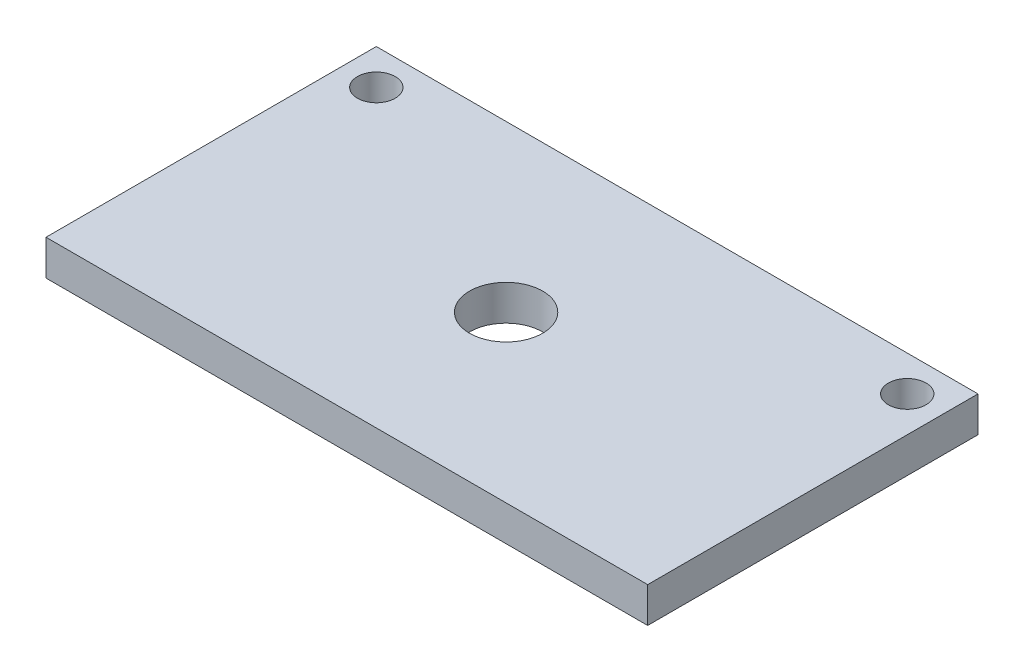
ISO-10303-21;
HEADER;
FILE_DESCRIPTION(('STEP AP214'),'2;1');
FILE_NAME('part.step','',(''),(''),'','','');
FILE_SCHEMA(('AUTOMOTIVE_DESIGN { 1 0 10303 214 1 1 1 1 }'));
ENDSEC;
DATA;
#1=APPLICATION_CONTEXT('core data for automotive mechanical design processes');
#2=APPLICATION_PROTOCOL_DEFINITION('international standard','automotive_design',2000,#1);
#3=PRODUCT_CONTEXT('',#1,'mechanical');
#4=PRODUCT('Part','Part','',(#3));
#5=PRODUCT_RELATED_PRODUCT_CATEGORY('part','',(#4));
#6=PRODUCT_DEFINITION_FORMATION('','',#4);
#7=PRODUCT_DEFINITION_CONTEXT('part definition',#1,'design');
#8=PRODUCT_DEFINITION('design','',#6,#7);
#9=PRODUCT_DEFINITION_SHAPE('','',#8);
#10=(LENGTH_UNIT() NAMED_UNIT(*) SI_UNIT(.MILLI.,.METRE.));
#11=(NAMED_UNIT(*) PLANE_ANGLE_UNIT() SI_UNIT($,.RADIAN.));
#12=(NAMED_UNIT(*) SI_UNIT($,.STERADIAN.) SOLID_ANGLE_UNIT());
#13=UNCERTAINTY_MEASURE_WITH_UNIT(LENGTH_MEASURE(1.E-05),#10,'distance_accuracy_value','');
#14=(GEOMETRIC_REPRESENTATION_CONTEXT(3) GLOBAL_UNCERTAINTY_ASSIGNED_CONTEXT((#13)) GLOBAL_UNIT_ASSIGNED_CONTEXT((#10,
#11,#12)) REPRESENTATION_CONTEXT('',''));
#15=CARTESIAN_POINT('',(0.,0.,0.));
#16=DIRECTION('',(0.,0.,1.));
#17=DIRECTION('',(1.,0.,0.));
#18=AXIS2_PLACEMENT_3D('',#15,#16,#17);
#19=CARTESIAN_POINT('',(-26.5822784810127,3.,-14.2405063291139));
#20=DIRECTION('',(1.,0.,0.));
#21=DIRECTION('',(0.,0.,-1.));
#22=AXIS2_PLACEMENT_3D('',#19,#20,#21);
#23=PLANE('',#22);
#24=DIRECTION('',(0.,0.,1.));
#25=VECTOR('',#24,1.);
#26=CARTESIAN_POINT('',(-26.5822784810127,0.,-14.2405063291139));
#27=LINE('',#26,#25);
#28=CARTESIAN_POINT('',(-26.5822784810127,0.,-14.2405063291139));
#29=VERTEX_POINT('',#28);
#30=CARTESIAN_POINT('',(-26.5822784810127,0.,13.7594936708861));
#31=VERTEX_POINT('',#30);
#32=EDGE_CURVE('E96',#29,#31,#27,.T.);
#33=ORIENTED_EDGE('',*,*,#32,.T.);
#34=DIRECTION('',(0.,-1.,0.));
#35=VECTOR('',#34,1.);
#36=CARTESIAN_POINT('',(-26.5822784810127,3.,13.7594936708861));
#37=LINE('',#36,#35);
#38=CARTESIAN_POINT('',(-26.5822784810127,3.,13.7594936708861));
#39=VERTEX_POINT('',#38);
#40=EDGE_CURVE('E11',#39,#31,#37,.T.);
#41=ORIENTED_EDGE('',*,*,#40,.F.);
#42=DIRECTION('',(0.,0.,1.));
#43=VECTOR('',#42,1.);
#44=CARTESIAN_POINT('',(-26.5822784810127,3.,-14.2405063291139));
#45=LINE('',#44,#43);
#46=CARTESIAN_POINT('',(-26.5822784810127,3.,-14.2405063291139));
#47=VERTEX_POINT('',#46);
#48=EDGE_CURVE('E84',#47,#39,#45,.T.);
#49=ORIENTED_EDGE('',*,*,#48,.F.);
#50=DIRECTION('',(0.,-1.,0.));
#51=VECTOR('',#50,1.);
#52=CARTESIAN_POINT('',(-26.5822784810127,3.,-14.2405063291139));
#53=LINE('',#52,#51);
#54=EDGE_CURVE('E92',#47,#29,#53,.T.);
#55=ORIENTED_EDGE('',*,*,#54,.T.);
#56=EDGE_LOOP('',(#33,#41,#49,#55));
#57=FACE_BOUND('',#56,.T.);
#58=ADVANCED_FACE('F33',(#57),#23,.F.);
#59=CARTESIAN_POINT('',(-26.5822784810127,3.,13.7594936708861));
#60=DIRECTION('',(0.,0.,-1.));
#61=DIRECTION('',(-1.,0.,0.));
#62=AXIS2_PLACEMENT_3D('',#59,#60,#61);
#63=PLANE('',#62);
#64=DIRECTION('',(1.,0.,0.));
#65=VECTOR('',#64,1.);
#66=CARTESIAN_POINT('',(-26.5822784810127,0.,13.7594936708861));
#67=LINE('',#66,#65);
#68=CARTESIAN_POINT('',(24.4177215189873,0.,13.7594936708861));
#69=VERTEX_POINT('',#68);
#70=EDGE_CURVE('E88',#31,#69,#67,.T.);
#71=ORIENTED_EDGE('',*,*,#70,.T.);
#72=DIRECTION('',(0.,-1.,0.));
#73=VECTOR('',#72,1.);
#74=CARTESIAN_POINT('',(24.4177215189873,3.,13.7594936708861));
#75=LINE('',#74,#73);
#76=CARTESIAN_POINT('',(24.4177215189873,3.,13.7594936708861));
#77=VERTEX_POINT('',#76);
#78=EDGE_CURVE('E41',#77,#69,#75,.T.);
#79=ORIENTED_EDGE('',*,*,#78,.F.);
#80=DIRECTION('',(1.,0.,0.));
#81=VECTOR('',#80,1.);
#82=CARTESIAN_POINT('',(-26.5822784810127,3.,13.7594936708861));
#83=LINE('',#82,#81);
#84=EDGE_CURVE('E79',#39,#77,#83,.T.);
#85=ORIENTED_EDGE('',*,*,#84,.F.);
#86=ORIENTED_EDGE('',*,*,#40,.T.);
#87=EDGE_LOOP('',(#71,#79,#85,#86));
#88=FACE_BOUND('',#87,.T.);
#89=ADVANCED_FACE('F87',(#88),#63,.F.);
#90=CARTESIAN_POINT('',(24.4177215189873,3.,-14.2405063291139));
#91=DIRECTION('',(-1.,0.,0.));
#92=DIRECTION('',(0.,0.,1.));
#93=AXIS2_PLACEMENT_3D('',#90,#91,#92);
#94=PLANE('',#93);
#95=DIRECTION('',(0.,0.,-1.));
#96=VECTOR('',#95,1.);
#97=CARTESIAN_POINT('',(24.4177215189873,0.,-14.2405063291139));
#98=LINE('',#97,#96);
#99=CARTESIAN_POINT('',(24.4177215189873,0.,-14.2405063291139));
#100=VERTEX_POINT('',#99);
#101=EDGE_CURVE('E66',#69,#100,#98,.T.);
#102=ORIENTED_EDGE('',*,*,#101,.T.);
#103=DIRECTION('',(0.,-1.,0.));
#104=VECTOR('',#103,1.);
#105=CARTESIAN_POINT('',(24.4177215189873,3.,-14.2405063291139));
#106=LINE('',#105,#104);
#107=CARTESIAN_POINT('',(24.4177215189873,3.,-14.2405063291139));
#108=VERTEX_POINT('',#107);
#109=EDGE_CURVE('E89',#108,#100,#106,.T.);
#110=ORIENTED_EDGE('',*,*,#109,.F.);
#111=DIRECTION('',(0.,0.,-1.));
#112=VECTOR('',#111,1.);
#113=CARTESIAN_POINT('',(24.4177215189873,3.,-14.2405063291139));
#114=LINE('',#113,#112);
#115=EDGE_CURVE('E82',#77,#108,#114,.T.);
#116=ORIENTED_EDGE('',*,*,#115,.F.);
#117=ORIENTED_EDGE('',*,*,#78,.T.);
#118=EDGE_LOOP('',(#102,#110,#116,#117));
#119=FACE_BOUND('',#118,.T.);
#120=ADVANCED_FACE('F90',(#119),#94,.F.);
#121=CARTESIAN_POINT('',(-26.5822784810127,3.,-14.2405063291139));
#122=DIRECTION('',(0.,0.,1.));
#123=DIRECTION('',(1.,0.,0.));
#124=AXIS2_PLACEMENT_3D('',#121,#122,#123);
#125=PLANE('',#124);
#126=DIRECTION('',(-1.,0.,0.));
#127=VECTOR('',#126,1.);
#128=CARTESIAN_POINT('',(-26.5822784810127,0.,-14.2405063291139));
#129=LINE('',#128,#127);
#130=EDGE_CURVE('E72',#100,#29,#129,.T.);
#131=ORIENTED_EDGE('',*,*,#130,.T.);
#132=ORIENTED_EDGE('',*,*,#54,.F.);
#133=DIRECTION('',(-1.,0.,0.));
#134=VECTOR('',#133,1.);
#135=CARTESIAN_POINT('',(-26.5822784810127,3.,-14.2405063291139));
#136=LINE('',#135,#134);
#137=EDGE_CURVE('E49',#108,#47,#136,.T.);
#138=ORIENTED_EDGE('',*,*,#137,.F.);
#139=ORIENTED_EDGE('',*,*,#109,.T.);
#140=EDGE_LOOP('',(#131,#132,#138,#139));
#141=FACE_BOUND('',#140,.T.);
#142=ADVANCED_FACE('F104',(#141),#125,.F.);
#143=CARTESIAN_POINT('',(0.,3.,0.));
#144=DIRECTION('',(0.,1.,0.));
#145=DIRECTION('',(0.,0.,1.));
#146=AXIS2_PLACEMENT_3D('',#143,#144,#145);
#147=PLANE('',#146);
#148=CARTESIAN_POINT('',(-1.58227848101266,3.,-0.240506329113922));
#149=DIRECTION('',(0.,1.,0.));
#150=DIRECTION('',(0.,0.,1.));
#151=AXIS2_PLACEMENT_3D('',#148,#149,#150);
#152=CIRCLE('',#151,3.1);
#153=CARTESIAN_POINT('',(-1.58227848101266,3.,2.85949367088608));
#154=VERTEX_POINT('',#153);
#155=EDGE_CURVE('E122',#154,#154,#152,.T.);
#156=ORIENTED_EDGE('',*,*,#155,.F.);
#157=EDGE_LOOP('',(#156));
#158=FACE_BOUND('',#157,.T.);
#159=CARTESIAN_POINT('',(-23.5822784810127,3.,-11.2405063291139));
#160=DIRECTION('',(0.,1.,0.));
#161=DIRECTION('',(0.,0.,1.));
#162=AXIS2_PLACEMENT_3D('',#159,#160,#161);
#163=CIRCLE('',#162,1.6);
#164=CARTESIAN_POINT('',(-23.5822784810127,3.,-9.64050632911392));
#165=VERTEX_POINT('',#164);
#166=EDGE_CURVE('E117',#165,#165,#163,.T.);
#167=ORIENTED_EDGE('',*,*,#166,.F.);
#168=EDGE_LOOP('',(#167));
#169=FACE_BOUND('',#168,.T.);
#170=CARTESIAN_POINT('',(21.4177215189873,3.,-11.2405063291139));
#171=DIRECTION('',(0.,1.,0.));
#172=DIRECTION('',(0.,0.,1.));
#173=AXIS2_PLACEMENT_3D('',#170,#171,#172);
#174=CIRCLE('',#173,1.6);
#175=CARTESIAN_POINT('',(21.4177215189873,3.,-9.64050632911392));
#176=VERTEX_POINT('',#175);
#177=EDGE_CURVE('E110',#176,#176,#174,.T.);
#178=ORIENTED_EDGE('',*,*,#177,.F.);
#179=EDGE_LOOP('',(#178));
#180=FACE_BOUND('',#179,.T.);
#181=ORIENTED_EDGE('',*,*,#48,.T.);
#182=ORIENTED_EDGE('',*,*,#84,.T.);
#183=ORIENTED_EDGE('',*,*,#115,.T.);
#184=ORIENTED_EDGE('',*,*,#137,.T.);
#185=EDGE_LOOP('',(#181,#182,#183,#184));
#186=FACE_BOUND('',#185,.T.);
#187=ADVANCED_FACE('F80',(#158,#169,#180,#186),#147,.T.);
#188=CARTESIAN_POINT('',(0.,0.,0.));
#189=DIRECTION('',(0.,1.,0.));
#190=DIRECTION('',(0.,0.,1.));
#191=AXIS2_PLACEMENT_3D('',#188,#189,#190);
#192=PLANE('',#191);
#193=CARTESIAN_POINT('',(-1.58227848101266,0.,-0.240506329113922));
#194=DIRECTION('',(0.,1.,0.));
#195=DIRECTION('',(0.,0.,1.));
#196=AXIS2_PLACEMENT_3D('',#193,#194,#195);
#197=CIRCLE('',#196,3.1);
#198=CARTESIAN_POINT('',(-1.58227848101266,0.,2.85949367088608));
#199=VERTEX_POINT('',#198);
#200=EDGE_CURVE('E114',#199,#199,#197,.T.);
#201=ORIENTED_EDGE('',*,*,#200,.T.);
#202=EDGE_LOOP('',(#201));
#203=FACE_BOUND('',#202,.T.);
#204=CARTESIAN_POINT('',(-23.5822784810127,0.,-11.2405063291139));
#205=DIRECTION('',(0.,1.,0.));
#206=DIRECTION('',(0.,0.,1.));
#207=AXIS2_PLACEMENT_3D('',#204,#205,#206);
#208=CIRCLE('',#207,1.6);
#209=CARTESIAN_POINT('',(-23.5822784810127,0.,-9.64050632911392));
#210=VERTEX_POINT('',#209);
#211=EDGE_CURVE('E99',#210,#210,#208,.T.);
#212=ORIENTED_EDGE('',*,*,#211,.T.);
#213=EDGE_LOOP('',(#212));
#214=FACE_BOUND('',#213,.T.);
#215=CARTESIAN_POINT('',(21.4177215189873,0.,-11.2405063291139));
#216=DIRECTION('',(0.,1.,0.));
#217=DIRECTION('',(0.,0.,1.));
#218=AXIS2_PLACEMENT_3D('',#215,#216,#217);
#219=CIRCLE('',#218,1.6);
#220=CARTESIAN_POINT('',(21.4177215189873,0.,-9.64050632911392));
#221=VERTEX_POINT('',#220);
#222=EDGE_CURVE('E113',#221,#221,#219,.T.);
#223=ORIENTED_EDGE('',*,*,#222,.T.);
#224=EDGE_LOOP('',(#223));
#225=FACE_BOUND('',#224,.T.);
#226=ORIENTED_EDGE('',*,*,#32,.F.);
#227=ORIENTED_EDGE('',*,*,#130,.F.);
#228=ORIENTED_EDGE('',*,*,#101,.F.);
#229=ORIENTED_EDGE('',*,*,#70,.F.);
#230=EDGE_LOOP('',(#226,#227,#228,#229));
#231=FACE_BOUND('',#230,.T.);
#232=ADVANCED_FACE('F107',(#203,#214,#225,#231),#192,.F.);
#233=CARTESIAN_POINT('',(21.4177215189873,0.,-11.2405063291139));
#234=DIRECTION('',(0.,1.,0.));
#235=DIRECTION('',(0.,0.,1.));
#236=AXIS2_PLACEMENT_3D('',#233,#234,#235);
#237=CYLINDRICAL_SURFACE('',#236,1.6);
#238=ORIENTED_EDGE('',*,*,#222,.F.);
#239=EDGE_LOOP('',(#238));
#240=FACE_BOUND('',#239,.T.);
#241=ORIENTED_EDGE('',*,*,#177,.T.);
#242=EDGE_LOOP('',(#241));
#243=FACE_BOUND('',#242,.T.);
#244=ADVANCED_FACE('F144',(#240,#243),#237,.F.);
#245=CARTESIAN_POINT('',(-23.5822784810127,0.,-11.2405063291139));
#246=DIRECTION('',(0.,1.,0.));
#247=DIRECTION('',(0.,0.,1.));
#248=AXIS2_PLACEMENT_3D('',#245,#246,#247);
#249=CYLINDRICAL_SURFACE('',#248,1.6);
#250=ORIENTED_EDGE('',*,*,#211,.F.);
#251=EDGE_LOOP('',(#250));
#252=FACE_BOUND('',#251,.T.);
#253=ORIENTED_EDGE('',*,*,#166,.T.);
#254=EDGE_LOOP('',(#253));
#255=FACE_BOUND('',#254,.T.);
#256=ADVANCED_FACE('F133',(#252,#255),#249,.F.);
#257=CARTESIAN_POINT('',(-1.58227848101266,0.,-0.240506329113922));
#258=DIRECTION('',(0.,1.,0.));
#259=DIRECTION('',(0.,0.,1.));
#260=AXIS2_PLACEMENT_3D('',#257,#258,#259);
#261=CYLINDRICAL_SURFACE('',#260,3.1);
#262=ORIENTED_EDGE('',*,*,#200,.F.);
#263=EDGE_LOOP('',(#262));
#264=FACE_BOUND('',#263,.T.);
#265=ORIENTED_EDGE('',*,*,#155,.T.);
#266=EDGE_LOOP('',(#265));
#267=FACE_BOUND('',#266,.T.);
#268=ADVANCED_FACE('F130',(#264,#267),#261,.F.);
#269=CLOSED_SHELL('',(#58,#89,#120,#142,#187,#232,#244,#256,#268));
#270=MANIFOLD_SOLID_BREP('B2',#269);
#271=ADVANCED_BREP_SHAPE_REPRESENTATION('',(#18,#270),#14);
#272=SHAPE_DEFINITION_REPRESENTATION(#9,#271);
ENDSEC;
END-ISO-10303-21;
